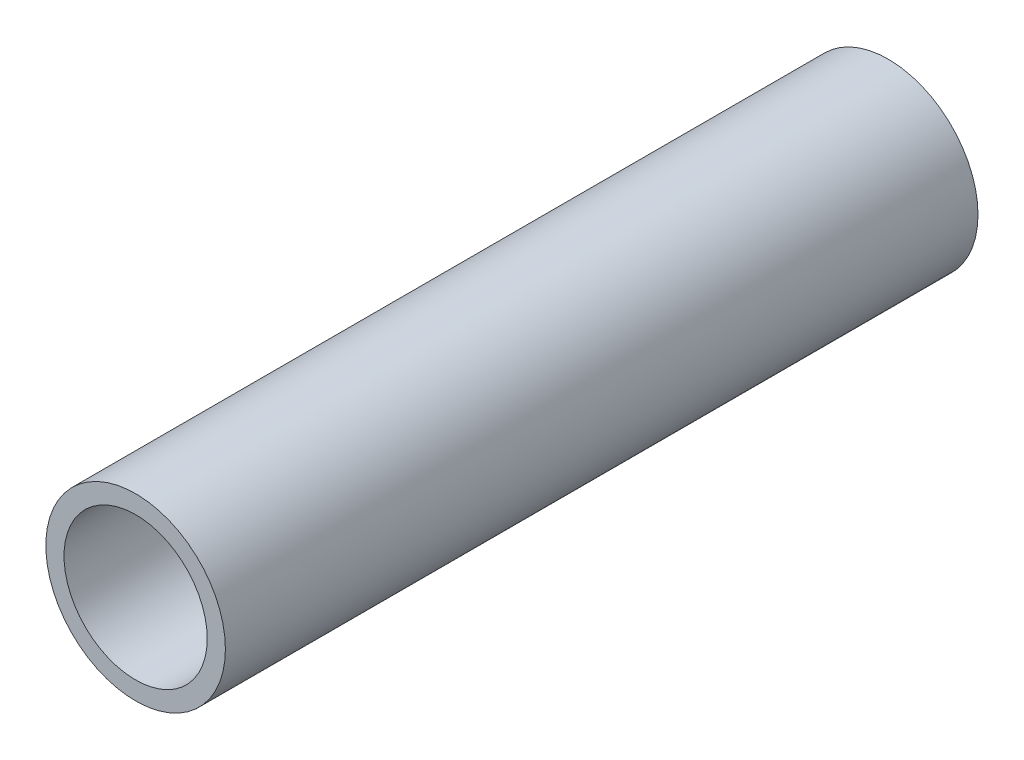
ISO-10303-21;
HEADER;
FILE_DESCRIPTION(('STEP AP214'),'2;1');
FILE_NAME('part.step','',(''),(''),'','','');
FILE_SCHEMA(('AUTOMOTIVE_DESIGN { 1 0 10303 214 1 1 1 1 }'));
ENDSEC;
DATA;
#1=APPLICATION_CONTEXT('core data for automotive mechanical design processes');
#2=APPLICATION_PROTOCOL_DEFINITION('international standard','automotive_design',2000,#1);
#3=PRODUCT_CONTEXT('',#1,'mechanical');
#4=PRODUCT('Part','Part','',(#3));
#5=PRODUCT_RELATED_PRODUCT_CATEGORY('part','',(#4));
#6=PRODUCT_DEFINITION_FORMATION('','',#4);
#7=PRODUCT_DEFINITION_CONTEXT('part definition',#1,'design');
#8=PRODUCT_DEFINITION('design','',#6,#7);
#9=PRODUCT_DEFINITION_SHAPE('','',#8);
#10=(LENGTH_UNIT() NAMED_UNIT(*) SI_UNIT(.MILLI.,.METRE.));
#11=(NAMED_UNIT(*) PLANE_ANGLE_UNIT() SI_UNIT($,.RADIAN.));
#12=(NAMED_UNIT(*) SI_UNIT($,.STERADIAN.) SOLID_ANGLE_UNIT());
#13=UNCERTAINTY_MEASURE_WITH_UNIT(LENGTH_MEASURE(1.E-05),#10,'distance_accuracy_value','');
#14=(GEOMETRIC_REPRESENTATION_CONTEXT(3) GLOBAL_UNCERTAINTY_ASSIGNED_CONTEXT((#13)) GLOBAL_UNIT_ASSIGNED_CONTEXT((#10,
#11,#12)) REPRESENTATION_CONTEXT('',''));
#15=CARTESIAN_POINT('',(0.,0.,0.));
#16=DIRECTION('',(0.,0.,1.));
#17=DIRECTION('',(1.,0.,0.));
#18=AXIS2_PLACEMENT_3D('',#15,#16,#17);
#19=CARTESIAN_POINT('',(0.,0.,70.));
#20=DIRECTION('',(0.,0.,1.));
#21=DIRECTION('',(1.,0.,0.));
#22=AXIS2_PLACEMENT_3D('',#19,#20,#21);
#23=PLANE('',#22);
#24=CARTESIAN_POINT('',(0.,0.,70.));
#25=DIRECTION('',(0.,0.,1.));
#26=DIRECTION('',(1.,0.,0.));
#27=AXIS2_PLACEMENT_3D('',#24,#25,#26);
#28=CIRCLE('',#27,16.7005);
#29=CARTESIAN_POINT('',(16.7005,0.,70.));
#30=VERTEX_POINT('',#29);
#31=EDGE_CURVE('E11',#30,#30,#28,.T.);
#32=ORIENTED_EDGE('',*,*,#31,.T.);
#33=EDGE_LOOP('',(#32));
#34=FACE_BOUND('',#33,.T.);
#35=CARTESIAN_POINT('',(0.,0.,70.));
#36=DIRECTION('',(0.,0.,1.));
#37=DIRECTION('',(1.,0.,0.));
#38=AXIS2_PLACEMENT_3D('',#35,#36,#37);
#39=CIRCLE('',#38,13.3223);
#40=CARTESIAN_POINT('',(13.3223,0.,70.));
#41=VERTEX_POINT('',#40);
#42=EDGE_CURVE('E47',#41,#41,#39,.T.);
#43=ORIENTED_EDGE('',*,*,#42,.F.);
#44=EDGE_LOOP('',(#43));
#45=FACE_BOUND('',#44,.T.);
#46=ADVANCED_FACE('F36',(#34,#45),#23,.T.);
#47=CARTESIAN_POINT('',(0.,0.,-70.));
#48=DIRECTION('',(0.,0.,1.));
#49=DIRECTION('',(1.,0.,0.));
#50=AXIS2_PLACEMENT_3D('',#47,#48,#49);
#51=PLANE('',#50);
#52=CARTESIAN_POINT('',(0.,0.,-70.));
#53=DIRECTION('',(0.,0.,1.));
#54=DIRECTION('',(1.,0.,0.));
#55=AXIS2_PLACEMENT_3D('',#52,#53,#54);
#56=CIRCLE('',#55,16.7005);
#57=CARTESIAN_POINT('',(16.7005,0.,-70.));
#58=VERTEX_POINT('',#57);
#59=EDGE_CURVE('E40',#58,#58,#56,.T.);
#60=ORIENTED_EDGE('',*,*,#59,.F.);
#61=EDGE_LOOP('',(#60));
#62=FACE_BOUND('',#61,.T.);
#63=CARTESIAN_POINT('',(0.,0.,-70.));
#64=DIRECTION('',(0.,0.,1.));
#65=DIRECTION('',(1.,0.,0.));
#66=AXIS2_PLACEMENT_3D('',#63,#64,#65);
#67=CIRCLE('',#66,13.3223);
#68=CARTESIAN_POINT('',(13.3223,0.,-70.));
#69=VERTEX_POINT('',#68);
#70=EDGE_CURVE('E49',#69,#69,#67,.T.);
#71=ORIENTED_EDGE('',*,*,#70,.T.);
#72=EDGE_LOOP('',(#71));
#73=FACE_BOUND('',#72,.T.);
#74=ADVANCED_FACE('F59',(#62,#73),#51,.F.);
#75=CARTESIAN_POINT('',(0.,0.,70.));
#76=DIRECTION('',(0.,0.,-1.));
#77=DIRECTION('',(-1.,0.,0.));
#78=AXIS2_PLACEMENT_3D('',#75,#76,#77);
#79=CYLINDRICAL_SURFACE('',#78,16.7005);
#80=ORIENTED_EDGE('',*,*,#31,.F.);
#81=EDGE_LOOP('',(#80));
#82=FACE_BOUND('',#81,.T.);
#83=ORIENTED_EDGE('',*,*,#59,.T.);
#84=EDGE_LOOP('',(#83));
#85=FACE_BOUND('',#84,.T.);
#86=ADVANCED_FACE('F38',(#82,#85),#79,.T.);
#87=CARTESIAN_POINT('',(0.,0.,70.));
#88=DIRECTION('',(0.,0.,-1.));
#89=DIRECTION('',(-1.,0.,0.));
#90=AXIS2_PLACEMENT_3D('',#87,#88,#89);
#91=CYLINDRICAL_SURFACE('',#90,13.3223);
#92=ORIENTED_EDGE('',*,*,#42,.T.);
#93=EDGE_LOOP('',(#92));
#94=FACE_BOUND('',#93,.T.);
#95=ORIENTED_EDGE('',*,*,#70,.F.);
#96=EDGE_LOOP('',(#95));
#97=FACE_BOUND('',#96,.T.);
#98=ADVANCED_FACE('F55',(#94,#97),#91,.F.);
#99=CLOSED_SHELL('',(#46,#74,#86,#98));
#100=MANIFOLD_SOLID_BREP('B2',#99);
#101=ADVANCED_BREP_SHAPE_REPRESENTATION('',(#18,#100),#14);
#102=SHAPE_DEFINITION_REPRESENTATION(#9,#101);
ENDSEC;
END-ISO-10303-21;
